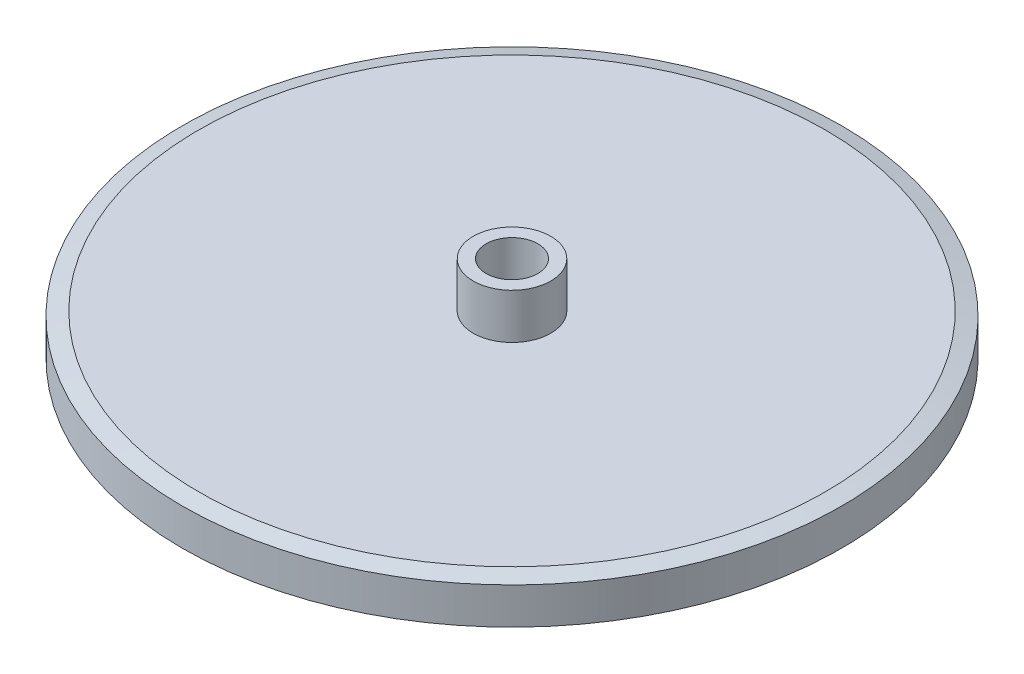
ISO-10303-21;
HEADER;
FILE_DESCRIPTION(('STEP AP214'),'2;1');
FILE_NAME('part.step','',(''),(''),'','','');
FILE_SCHEMA(('AUTOMOTIVE_DESIGN { 1 0 10303 214 1 1 1 1 }'));
ENDSEC;
DATA;
#1=APPLICATION_CONTEXT('core data for automotive mechanical design processes');
#2=APPLICATION_PROTOCOL_DEFINITION('international standard','automotive_design',2000,#1);
#3=PRODUCT_CONTEXT('',#1,'mechanical');
#4=PRODUCT('Part','Part','',(#3));
#5=PRODUCT_RELATED_PRODUCT_CATEGORY('part','',(#4));
#6=PRODUCT_DEFINITION_FORMATION('','',#4);
#7=PRODUCT_DEFINITION_CONTEXT('part definition',#1,'design');
#8=PRODUCT_DEFINITION('design','',#6,#7);
#9=PRODUCT_DEFINITION_SHAPE('','',#8);
#10=(LENGTH_UNIT() NAMED_UNIT(*) SI_UNIT(.MILLI.,.METRE.));
#11=(NAMED_UNIT(*) PLANE_ANGLE_UNIT() SI_UNIT($,.RADIAN.));
#12=(NAMED_UNIT(*) SI_UNIT($,.STERADIAN.) SOLID_ANGLE_UNIT());
#13=UNCERTAINTY_MEASURE_WITH_UNIT(LENGTH_MEASURE(1.E-05),#10,'distance_accuracy_value','');
#14=(GEOMETRIC_REPRESENTATION_CONTEXT(3) GLOBAL_UNCERTAINTY_ASSIGNED_CONTEXT((#13)) GLOBAL_UNIT_ASSIGNED_CONTEXT((#10,
#11,#12)) REPRESENTATION_CONTEXT('',''));
#15=CARTESIAN_POINT('',(0.,0.,0.));
#16=DIRECTION('',(0.,0.,1.));
#17=DIRECTION('',(1.,0.,0.));
#18=AXIS2_PLACEMENT_3D('',#15,#16,#17);
#19=CARTESIAN_POINT('',(0.,0.,0.));
#20=DIRECTION('',(0.,1.,0.));
#21=DIRECTION('',(0.,0.,1.));
#22=AXIS2_PLACEMENT_3D('',#19,#20,#21);
#23=PLANE('',#22);
#24=CARTESIAN_POINT('',(0.,0.,0.));
#25=DIRECTION('',(0.,1.,0.));
#26=DIRECTION('',(0.,0.,1.));
#27=AXIS2_PLACEMENT_3D('',#24,#25,#26);
#28=CIRCLE('',#27,24.25);
#29=CARTESIAN_POINT('',(0.,0.,24.25));
#30=VERTEX_POINT('',#29);
#31=EDGE_CURVE('E10',#30,#30,#28,.F.);
#32=ORIENTED_EDGE('',*,*,#31,.T.);
#33=EDGE_LOOP('',(#32));
#34=FACE_BOUND('',#33,.T.);
#35=CARTESIAN_POINT('',(0.,0.,0.));
#36=DIRECTION('',(0.,-1.,0.));
#37=DIRECTION('',(0.,0.,-1.));
#38=AXIS2_PLACEMENT_3D('',#35,#36,#37);
#39=CIRCLE('',#38,2.);
#40=CARTESIAN_POINT('',(0.,0.,-2.));
#41=VERTEX_POINT('',#40);
#42=EDGE_CURVE('E64',#41,#41,#39,.T.);
#43=ORIENTED_EDGE('',*,*,#42,.F.);
#44=EDGE_LOOP('',(#43));
#45=FACE_BOUND('',#44,.T.);
#46=ADVANCED_FACE('F36',(#34,#45),#23,.F.);
#47=CARTESIAN_POINT('',(0.,7.,0.));
#48=DIRECTION('',(0.,1.,0.));
#49=DIRECTION('',(0.,0.,1.));
#50=AXIS2_PLACEMENT_3D('',#47,#48,#49);
#51=CYLINDRICAL_SURFACE('',#50,25.5);
#52=CARTESIAN_POINT('',(0.,0.334936490538904,0.));
#53=DIRECTION('',(0.,1.,0.));
#54=DIRECTION('',(0.,0.,1.));
#55=AXIS2_PLACEMENT_3D('',#52,#53,#54);
#56=CIRCLE('',#55,25.5);
#57=CARTESIAN_POINT('',(0.,0.334936490538904,25.5));
#58=VERTEX_POINT('',#57);
#59=EDGE_CURVE('E44',#58,#58,#56,.T.);
#60=ORIENTED_EDGE('',*,*,#59,.T.);
#61=EDGE_LOOP('',(#60));
#62=FACE_BOUND('',#61,.T.);
#63=CARTESIAN_POINT('',(0.,3.1650635094611,0.));
#64=DIRECTION('',(0.,-1.,0.));
#65=DIRECTION('',(0.,0.,-1.));
#66=AXIS2_PLACEMENT_3D('',#63,#64,#65);
#67=CIRCLE('',#66,25.5);
#68=CARTESIAN_POINT('',(0.,3.1650635094611,-25.5));
#69=VERTEX_POINT('',#68);
#70=EDGE_CURVE('E48',#69,#69,#67,.T.);
#71=ORIENTED_EDGE('',*,*,#70,.T.);
#72=EDGE_LOOP('',(#71));
#73=FACE_BOUND('',#72,.T.);
#74=ADVANCED_FACE('F81',(#62,#73),#51,.T.);
#75=CARTESIAN_POINT('',(25.5,3.5,0.));
#76=DIRECTION('',(0.,-1.,0.));
#77=DIRECTION('',(0.,0.,-1.));
#78=AXIS2_PLACEMENT_3D('',#75,#76,#77);
#79=PLANE('',#78);
#80=CARTESIAN_POINT('',(0.,3.5,0.));
#81=DIRECTION('',(0.,-1.,0.));
#82=DIRECTION('',(0.,0.,-1.));
#83=AXIS2_PLACEMENT_3D('',#80,#81,#82);
#84=CIRCLE('',#83,24.25);
#85=CARTESIAN_POINT('',(0.,3.5,-24.25));
#86=VERTEX_POINT('',#85);
#87=EDGE_CURVE('E52',#86,#86,#84,.F.);
#88=ORIENTED_EDGE('',*,*,#87,.T.);
#89=EDGE_LOOP('',(#88));
#90=FACE_BOUND('',#89,.T.);
#91=CARTESIAN_POINT('',(0.,3.5,0.));
#92=DIRECTION('',(0.,1.,0.));
#93=DIRECTION('',(0.,0.,1.));
#94=AXIS2_PLACEMENT_3D('',#91,#92,#93);
#95=CIRCLE('',#94,3.);
#96=CARTESIAN_POINT('',(0.,3.5,3.));
#97=VERTEX_POINT('',#96);
#98=EDGE_CURVE('E57',#97,#97,#95,.T.);
#99=ORIENTED_EDGE('',*,*,#98,.F.);
#100=EDGE_LOOP('',(#99));
#101=FACE_BOUND('',#100,.T.);
#102=ADVANCED_FACE('F86',(#90,#101),#79,.F.);
#103=CARTESIAN_POINT('',(0.,7.,0.));
#104=DIRECTION('',(0.,1.,0.));
#105=DIRECTION('',(0.,0.,1.));
#106=AXIS2_PLACEMENT_3D('',#103,#104,#105);
#107=CYLINDRICAL_SURFACE('',#106,3.);
#108=CARTESIAN_POINT('',(0.,7.,0.));
#109=DIRECTION('',(0.,1.,0.));
#110=DIRECTION('',(0.,0.,1.));
#111=AXIS2_PLACEMENT_3D('',#108,#109,#110);
#112=CIRCLE('',#111,3.);
#113=CARTESIAN_POINT('',(0.,7.,3.));
#114=VERTEX_POINT('',#113);
#115=EDGE_CURVE('E60',#114,#114,#112,.T.);
#116=ORIENTED_EDGE('',*,*,#115,.F.);
#117=EDGE_LOOP('',(#116));
#118=FACE_BOUND('',#117,.T.);
#119=ORIENTED_EDGE('',*,*,#98,.T.);
#120=EDGE_LOOP('',(#119));
#121=FACE_BOUND('',#120,.T.);
#122=ADVANCED_FACE('F97',(#118,#121),#107,.T.);
#123=CARTESIAN_POINT('',(3.,7.,0.));
#124=DIRECTION('',(0.,-1.,0.));
#125=DIRECTION('',(0.,0.,-1.));
#126=AXIS2_PLACEMENT_3D('',#123,#124,#125);
#127=PLANE('',#126);
#128=CARTESIAN_POINT('',(0.,7.,0.));
#129=DIRECTION('',(0.,-1.,0.));
#130=DIRECTION('',(0.,0.,-1.));
#131=AXIS2_PLACEMENT_3D('',#128,#129,#130);
#132=CIRCLE('',#131,2.);
#133=CARTESIAN_POINT('',(0.,7.,-2.));
#134=VERTEX_POINT('',#133);
#135=EDGE_CURVE('E63',#134,#134,#132,.T.);
#136=ORIENTED_EDGE('',*,*,#135,.T.);
#137=EDGE_LOOP('',(#136));
#138=FACE_BOUND('',#137,.T.);
#139=ORIENTED_EDGE('',*,*,#115,.T.);
#140=EDGE_LOOP('',(#139));
#141=FACE_BOUND('',#140,.T.);
#142=ADVANCED_FACE('F70',(#138,#141),#127,.F.);
#143=CARTESIAN_POINT('',(0.,3.5,0.));
#144=DIRECTION('',(0.,-1.,0.));
#145=DIRECTION('',(0.,0.,-1.));
#146=AXIS2_PLACEMENT_3D('',#143,#144,#145);
#147=CONICAL_SURFACE('',#146,24.25,1.30899693899575);
#148=ORIENTED_EDGE('',*,*,#70,.F.);
#149=EDGE_LOOP('',(#148));
#150=FACE_BOUND('',#149,.T.);
#151=ORIENTED_EDGE('',*,*,#87,.F.);
#152=EDGE_LOOP('',(#151));
#153=FACE_BOUND('',#152,.T.);
#154=ADVANCED_FACE('F76',(#150,#153),#147,.T.);
#155=CARTESIAN_POINT('',(0.,7.,0.));
#156=DIRECTION('',(0.,-1.,0.));
#157=DIRECTION('',(0.,0.,-1.));
#158=AXIS2_PLACEMENT_3D('',#155,#156,#157);
#159=CYLINDRICAL_SURFACE('',#158,2.);
#160=ORIENTED_EDGE('',*,*,#135,.F.);
#161=EDGE_LOOP('',(#160));
#162=FACE_BOUND('',#161,.T.);
#163=ORIENTED_EDGE('',*,*,#42,.T.);
#164=EDGE_LOOP('',(#163));
#165=FACE_BOUND('',#164,.T.);
#166=ADVANCED_FACE('F73',(#162,#165),#159,.F.);
#167=CARTESIAN_POINT('',(0.,0.334936490538904,0.));
#168=DIRECTION('',(0.,1.,0.));
#169=DIRECTION('',(0.,0.,1.));
#170=AXIS2_PLACEMENT_3D('',#167,#168,#169);
#171=CONICAL_SURFACE('',#170,25.5,1.30899693899575);
#172=ORIENTED_EDGE('',*,*,#31,.F.);
#173=EDGE_LOOP('',(#172));
#174=FACE_BOUND('',#173,.T.);
#175=ORIENTED_EDGE('',*,*,#59,.F.);
#176=EDGE_LOOP('',(#175));
#177=FACE_BOUND('',#176,.T.);
#178=ADVANCED_FACE('F39',(#174,#177),#171,.T.);
#179=CLOSED_SHELL('',(#46,#74,#102,#122,#142,#154,#166,#178));
#180=MANIFOLD_SOLID_BREP('B2',#179);
#181=ADVANCED_BREP_SHAPE_REPRESENTATION('',(#18,#180),#14);
#182=SHAPE_DEFINITION_REPRESENTATION(#9,#181);
ENDSEC;
END-ISO-10303-21;
